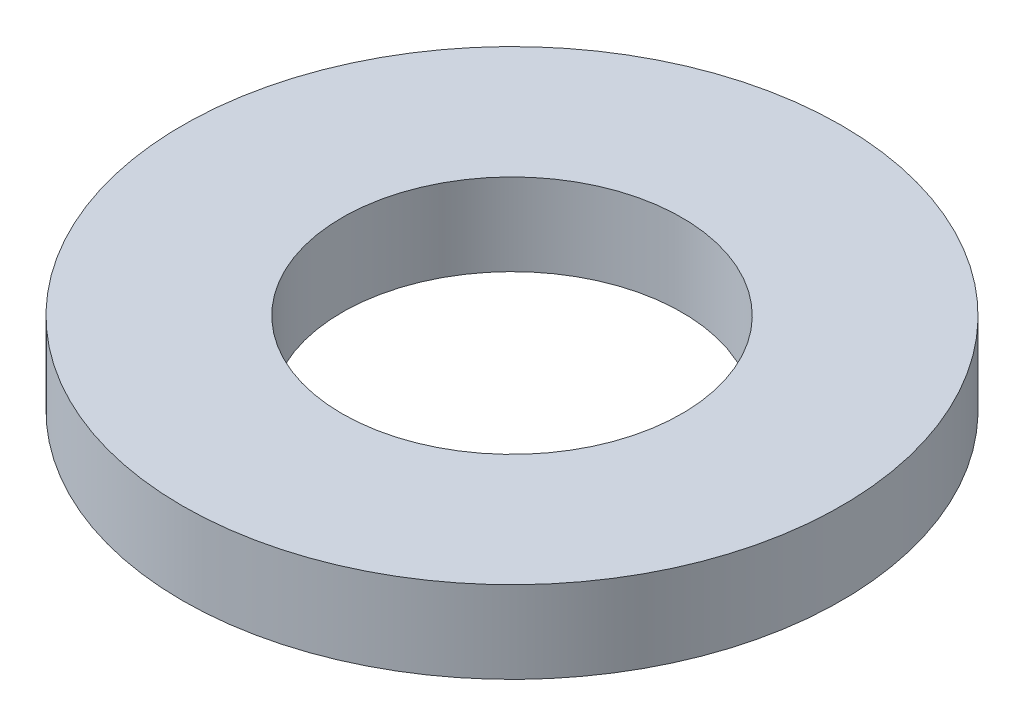
ISO-10303-21;
HEADER;
FILE_DESCRIPTION(('STEP AP214'),'2;1');
FILE_NAME('part.step','',(''),(''),'','','');
FILE_SCHEMA(('AUTOMOTIVE_DESIGN { 1 0 10303 214 1 1 1 1 }'));
ENDSEC;
DATA;
#1=APPLICATION_CONTEXT('core data for automotive mechanical design processes');
#2=APPLICATION_PROTOCOL_DEFINITION('international standard','automotive_design',2000,#1);
#3=PRODUCT_CONTEXT('',#1,'mechanical');
#4=PRODUCT('Part','Part','',(#3));
#5=PRODUCT_RELATED_PRODUCT_CATEGORY('part','',(#4));
#6=PRODUCT_DEFINITION_FORMATION('','',#4);
#7=PRODUCT_DEFINITION_CONTEXT('part definition',#1,'design');
#8=PRODUCT_DEFINITION('design','',#6,#7);
#9=PRODUCT_DEFINITION_SHAPE('','',#8);
#10=(LENGTH_UNIT() NAMED_UNIT(*) SI_UNIT(.MILLI.,.METRE.));
#11=(NAMED_UNIT(*) PLANE_ANGLE_UNIT() SI_UNIT($,.RADIAN.));
#12=(NAMED_UNIT(*) SI_UNIT($,.STERADIAN.) SOLID_ANGLE_UNIT());
#13=UNCERTAINTY_MEASURE_WITH_UNIT(LENGTH_MEASURE(1.E-05),#10,'distance_accuracy_value','');
#14=(GEOMETRIC_REPRESENTATION_CONTEXT(3) GLOBAL_UNCERTAINTY_ASSIGNED_CONTEXT((#13)) GLOBAL_UNIT_ASSIGNED_CONTEXT((#10,
#11,#12)) REPRESENTATION_CONTEXT('',''));
#15=CARTESIAN_POINT('',(0.,0.,0.));
#16=DIRECTION('',(0.,0.,1.));
#17=DIRECTION('',(1.,0.,0.));
#18=AXIS2_PLACEMENT_3D('',#15,#16,#17);
#19=CARTESIAN_POINT('',(0.,0.7112,0.));
#20=DIRECTION('',(0.,-1.,0.));
#21=DIRECTION('',(0.,0.,-1.));
#22=AXIS2_PLACEMENT_3D('',#19,#20,#21);
#23=CYLINDRICAL_SURFACE('',#22,2.8575);
#24=CARTESIAN_POINT('',(0.,0.7112,0.));
#25=DIRECTION('',(0.,1.,0.));
#26=DIRECTION('',(0.,0.,1.));
#27=AXIS2_PLACEMENT_3D('',#24,#25,#26);
#28=CIRCLE('',#27,2.8575);
#29=CARTESIAN_POINT('',(0.,0.7112,2.8575));
#30=VERTEX_POINT('',#29);
#31=EDGE_CURVE('E10',#30,#30,#28,.T.);
#32=ORIENTED_EDGE('',*,*,#31,.F.);
#33=EDGE_LOOP('',(#32));
#34=FACE_BOUND('',#33,.T.);
#35=CARTESIAN_POINT('',(0.,0.,0.));
#36=DIRECTION('',(0.,1.,0.));
#37=DIRECTION('',(0.,0.,1.));
#38=AXIS2_PLACEMENT_3D('',#35,#36,#37);
#39=CIRCLE('',#38,2.8575);
#40=CARTESIAN_POINT('',(0.,0.,2.8575));
#41=VERTEX_POINT('',#40);
#42=EDGE_CURVE('E33',#41,#41,#39,.T.);
#43=ORIENTED_EDGE('',*,*,#42,.T.);
#44=EDGE_LOOP('',(#43));
#45=FACE_BOUND('',#44,.T.);
#46=ADVANCED_FACE('F30',(#34,#45),#23,.T.);
#47=CARTESIAN_POINT('',(0.,0.7112,0.));
#48=DIRECTION('',(0.,1.,0.));
#49=DIRECTION('',(0.,0.,1.));
#50=AXIS2_PLACEMENT_3D('',#47,#48,#49);
#51=PLANE('',#50);
#52=CARTESIAN_POINT('',(0.,0.7112,0.));
#53=DIRECTION('',(0.,1.,0.));
#54=DIRECTION('',(0.,0.,1.));
#55=AXIS2_PLACEMENT_3D('',#52,#53,#54);
#56=CIRCLE('',#55,1.4732);
#57=CARTESIAN_POINT('',(0.,0.7112,1.4732));
#58=VERTEX_POINT('',#57);
#59=EDGE_CURVE('E44',#58,#58,#56,.T.);
#60=ORIENTED_EDGE('',*,*,#59,.F.);
#61=EDGE_LOOP('',(#60));
#62=FACE_BOUND('',#61,.T.);
#63=ORIENTED_EDGE('',*,*,#31,.T.);
#64=EDGE_LOOP('',(#63));
#65=FACE_BOUND('',#64,.T.);
#66=ADVANCED_FACE('F50',(#62,#65),#51,.T.);
#67=CARTESIAN_POINT('',(0.,0.,0.));
#68=DIRECTION('',(0.,1.,0.));
#69=DIRECTION('',(0.,0.,1.));
#70=AXIS2_PLACEMENT_3D('',#67,#68,#69);
#71=PLANE('',#70);
#72=CARTESIAN_POINT('',(0.,0.,0.));
#73=DIRECTION('',(0.,1.,0.));
#74=DIRECTION('',(0.,0.,1.));
#75=AXIS2_PLACEMENT_3D('',#72,#73,#74);
#76=CIRCLE('',#75,1.4732);
#77=CARTESIAN_POINT('',(0.,0.,1.4732));
#78=VERTEX_POINT('',#77);
#79=EDGE_CURVE('E40',#78,#78,#76,.T.);
#80=ORIENTED_EDGE('',*,*,#79,.T.);
#81=EDGE_LOOP('',(#80));
#82=FACE_BOUND('',#81,.T.);
#83=ORIENTED_EDGE('',*,*,#42,.F.);
#84=EDGE_LOOP('',(#83));
#85=FACE_BOUND('',#84,.T.);
#86=ADVANCED_FACE('F52',(#82,#85),#71,.F.);
#87=CARTESIAN_POINT('',(0.,0.7112,0.));
#88=DIRECTION('',(0.,1.,0.));
#89=DIRECTION('',(0.,0.,1.));
#90=AXIS2_PLACEMENT_3D('',#87,#88,#89);
#91=CYLINDRICAL_SURFACE('',#90,1.4732);
#92=ORIENTED_EDGE('',*,*,#79,.F.);
#93=EDGE_LOOP('',(#92));
#94=FACE_BOUND('',#93,.T.);
#95=ORIENTED_EDGE('',*,*,#59,.T.);
#96=EDGE_LOOP('',(#95));
#97=FACE_BOUND('',#96,.T.);
#98=ADVANCED_FACE('F48',(#94,#97),#91,.F.);
#99=CLOSED_SHELL('',(#46,#66,#86,#98));
#100=MANIFOLD_SOLID_BREP('B2',#99);
#101=ADVANCED_BREP_SHAPE_REPRESENTATION('',(#18,#100),#14);
#102=SHAPE_DEFINITION_REPRESENTATION(#9,#101);
ENDSEC;
END-ISO-10303-21;
